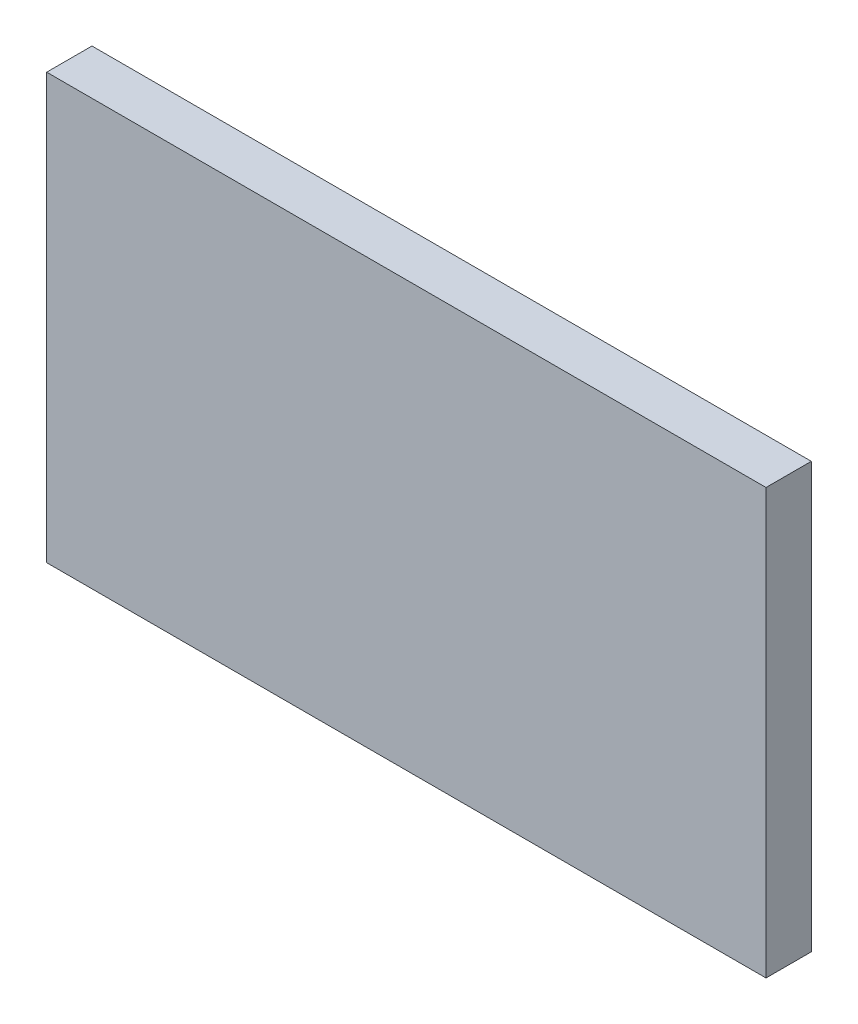
ISO-10303-21;
HEADER;
FILE_DESCRIPTION(('STEP AP214'),'2;1');
FILE_NAME('part.step','',(''),(''),'','','');
FILE_SCHEMA(('AUTOMOTIVE_DESIGN { 1 0 10303 214 1 1 1 1 }'));
ENDSEC;
DATA;
#1=APPLICATION_CONTEXT('core data for automotive mechanical design processes');
#2=APPLICATION_PROTOCOL_DEFINITION('international standard','automotive_design',2000,#1);
#3=PRODUCT_CONTEXT('',#1,'mechanical');
#4=PRODUCT('Part','Part','',(#3));
#5=PRODUCT_RELATED_PRODUCT_CATEGORY('part','',(#4));
#6=PRODUCT_DEFINITION_FORMATION('','',#4);
#7=PRODUCT_DEFINITION_CONTEXT('part definition',#1,'design');
#8=PRODUCT_DEFINITION('design','',#6,#7);
#9=PRODUCT_DEFINITION_SHAPE('','',#8);
#10=(LENGTH_UNIT() NAMED_UNIT(*) SI_UNIT(.MILLI.,.METRE.));
#11=(NAMED_UNIT(*) PLANE_ANGLE_UNIT() SI_UNIT($,.RADIAN.));
#12=(NAMED_UNIT(*) SI_UNIT($,.STERADIAN.) SOLID_ANGLE_UNIT());
#13=UNCERTAINTY_MEASURE_WITH_UNIT(LENGTH_MEASURE(1.E-05),#10,'distance_accuracy_value','');
#14=(GEOMETRIC_REPRESENTATION_CONTEXT(3) GLOBAL_UNCERTAINTY_ASSIGNED_CONTEXT((#13)) GLOBAL_UNIT_ASSIGNED_CONTEXT((#10,
#11,#12)) REPRESENTATION_CONTEXT('',''));
#15=CARTESIAN_POINT('',(0.,0.,0.));
#16=DIRECTION('',(0.,0.,1.));
#17=DIRECTION('',(1.,0.,0.));
#18=AXIS2_PLACEMENT_3D('',#15,#16,#17);
#19=CARTESIAN_POINT('',(0.,0.,6.4));
#20=DIRECTION('',(1.,0.,0.));
#21=DIRECTION('',(0.,0.,-1.));
#22=AXIS2_PLACEMENT_3D('',#19,#20,#21);
#23=PLANE('',#22);
#24=DIRECTION('',(0.,-1.,0.));
#25=VECTOR('',#24,1.);
#26=CARTESIAN_POINT('',(0.,0.,0.));
#27=LINE('',#26,#25);
#28=CARTESIAN_POINT('',(0.,60.,0.));
#29=VERTEX_POINT('',#28);
#30=CARTESIAN_POINT('',(0.,0.,0.));
#31=VERTEX_POINT('',#30);
#32=EDGE_CURVE('E109',#29,#31,#27,.T.);
#33=ORIENTED_EDGE('',*,*,#32,.T.);
#34=DIRECTION('',(0.,0.,-1.));
#35=VECTOR('',#34,1.);
#36=CARTESIAN_POINT('',(0.,0.,6.4));
#37=LINE('',#36,#35);
#38=CARTESIAN_POINT('',(0.,0.,6.4));
#39=VERTEX_POINT('',#38);
#40=EDGE_CURVE('E11',#39,#31,#37,.T.);
#41=ORIENTED_EDGE('',*,*,#40,.F.);
#42=DIRECTION('',(0.,-1.,0.));
#43=VECTOR('',#42,1.);
#44=CARTESIAN_POINT('',(0.,0.,6.4));
#45=LINE('',#44,#43);
#46=CARTESIAN_POINT('',(0.,60.,6.4));
#47=VERTEX_POINT('',#46);
#48=EDGE_CURVE('E93',#47,#39,#45,.T.);
#49=ORIENTED_EDGE('',*,*,#48,.F.);
#50=DIRECTION('',(0.,0.,-1.));
#51=VECTOR('',#50,1.);
#52=CARTESIAN_POINT('',(0.,60.,6.4));
#53=LINE('',#52,#51);
#54=EDGE_CURVE('E105',#47,#29,#53,.T.);
#55=ORIENTED_EDGE('',*,*,#54,.T.);
#56=EDGE_LOOP('',(#33,#41,#49,#55));
#57=FACE_BOUND('',#56,.T.);
#58=ADVANCED_FACE('F41',(#57),#23,.F.);
#59=CARTESIAN_POINT('',(0.,0.,6.4));
#60=DIRECTION('',(0.,1.,0.));
#61=DIRECTION('',(0.,0.,1.));
#62=AXIS2_PLACEMENT_3D('',#59,#60,#61);
#63=PLANE('',#62);
#64=DIRECTION('',(1.,0.,0.));
#65=VECTOR('',#64,1.);
#66=CARTESIAN_POINT('',(0.,0.,0.));
#67=LINE('',#66,#65);
#68=CARTESIAN_POINT('',(101.6,0.,0.));
#69=VERTEX_POINT('',#68);
#70=EDGE_CURVE('E98',#31,#69,#67,.T.);
#71=ORIENTED_EDGE('',*,*,#70,.T.);
#72=DIRECTION('',(0.,0.,-1.));
#73=VECTOR('',#72,1.);
#74=CARTESIAN_POINT('',(101.6,0.,6.4));
#75=LINE('',#74,#73);
#76=CARTESIAN_POINT('',(101.6,0.,6.4));
#77=VERTEX_POINT('',#76);
#78=EDGE_CURVE('E50',#77,#69,#75,.T.);
#79=ORIENTED_EDGE('',*,*,#78,.F.);
#80=DIRECTION('',(1.,0.,0.));
#81=VECTOR('',#80,1.);
#82=CARTESIAN_POINT('',(0.,0.,6.4));
#83=LINE('',#82,#81);
#84=EDGE_CURVE('E88',#39,#77,#83,.T.);
#85=ORIENTED_EDGE('',*,*,#84,.F.);
#86=ORIENTED_EDGE('',*,*,#40,.T.);
#87=EDGE_LOOP('',(#71,#79,#85,#86));
#88=FACE_BOUND('',#87,.T.);
#89=ADVANCED_FACE('F97',(#88),#63,.F.);
#90=CARTESIAN_POINT('',(101.6,0.,6.4));
#91=DIRECTION('',(-1.,0.,0.));
#92=DIRECTION('',(0.,0.,1.));
#93=AXIS2_PLACEMENT_3D('',#90,#91,#92);
#94=PLANE('',#93);
#95=DIRECTION('',(0.,1.,0.));
#96=VECTOR('',#95,1.);
#97=CARTESIAN_POINT('',(101.6,0.,0.));
#98=LINE('',#97,#96);
#99=CARTESIAN_POINT('',(101.6,60.,0.));
#100=VERTEX_POINT('',#99);
#101=EDGE_CURVE('E75',#69,#100,#98,.T.);
#102=ORIENTED_EDGE('',*,*,#101,.T.);
#103=DIRECTION('',(0.,0.,-1.));
#104=VECTOR('',#103,1.);
#105=CARTESIAN_POINT('',(101.6,60.,6.4));
#106=LINE('',#105,#104);
#107=CARTESIAN_POINT('',(101.6,60.,6.4));
#108=VERTEX_POINT('',#107);
#109=EDGE_CURVE('E100',#108,#100,#106,.T.);
#110=ORIENTED_EDGE('',*,*,#109,.F.);
#111=DIRECTION('',(0.,1.,0.));
#112=VECTOR('',#111,1.);
#113=CARTESIAN_POINT('',(101.6,0.,6.4));
#114=LINE('',#113,#112);
#115=EDGE_CURVE('E91',#77,#108,#114,.T.);
#116=ORIENTED_EDGE('',*,*,#115,.F.);
#117=ORIENTED_EDGE('',*,*,#78,.T.);
#118=EDGE_LOOP('',(#102,#110,#116,#117));
#119=FACE_BOUND('',#118,.T.);
#120=ADVANCED_FACE('F101',(#119),#94,.F.);
#121=CARTESIAN_POINT('',(0.,60.,6.4));
#122=DIRECTION('',(0.,-1.,0.));
#123=DIRECTION('',(0.,0.,-1.));
#124=AXIS2_PLACEMENT_3D('',#121,#122,#123);
#125=PLANE('',#124);
#126=DIRECTION('',(-1.,0.,0.));
#127=VECTOR('',#126,1.);
#128=CARTESIAN_POINT('',(0.,60.,0.));
#129=LINE('',#128,#127);
#130=EDGE_CURVE('E81',#100,#29,#129,.T.);
#131=ORIENTED_EDGE('',*,*,#130,.T.);
#132=ORIENTED_EDGE('',*,*,#54,.F.);
#133=DIRECTION('',(-1.,0.,0.));
#134=VECTOR('',#133,1.);
#135=CARTESIAN_POINT('',(0.,60.,6.4));
#136=LINE('',#135,#134);
#137=EDGE_CURVE('E58',#108,#47,#136,.T.);
#138=ORIENTED_EDGE('',*,*,#137,.F.);
#139=ORIENTED_EDGE('',*,*,#109,.T.);
#140=EDGE_LOOP('',(#131,#132,#138,#139));
#141=FACE_BOUND('',#140,.T.);
#142=ADVANCED_FACE('F122',(#141),#125,.F.);
#143=CARTESIAN_POINT('',(0.,0.,6.4));
#144=DIRECTION('',(0.,0.,-1.));
#145=DIRECTION('',(-1.,0.,0.));
#146=AXIS2_PLACEMENT_3D('',#143,#144,#145);
#147=PLANE('',#146);
#148=ORIENTED_EDGE('',*,*,#48,.T.);
#149=ORIENTED_EDGE('',*,*,#84,.T.);
#150=ORIENTED_EDGE('',*,*,#115,.T.);
#151=ORIENTED_EDGE('',*,*,#137,.T.);
#152=EDGE_LOOP('',(#148,#149,#150,#151));
#153=FACE_BOUND('',#152,.T.);
#154=ADVANCED_FACE('F89',(#153),#147,.F.);
#155=CARTESIAN_POINT('',(0.,0.,0.));
#156=DIRECTION('',(0.,0.,-1.));
#157=DIRECTION('',(-1.,0.,0.));
#158=AXIS2_PLACEMENT_3D('',#155,#156,#157);
#159=PLANE('',#158);
#160=ORIENTED_EDGE('',*,*,#32,.F.);
#161=ORIENTED_EDGE('',*,*,#130,.F.);
#162=ORIENTED_EDGE('',*,*,#101,.F.);
#163=ORIENTED_EDGE('',*,*,#70,.F.);
#164=EDGE_LOOP('',(#160,#161,#162,#163));
#165=FACE_BOUND('',#164,.T.);
#166=ADVANCED_FACE('F125',(#165),#159,.T.);
#167=CLOSED_SHELL('',(#58,#89,#120,#142,#154,#166));
#168=MANIFOLD_SOLID_BREP('B2',#167);
#169=ADVANCED_BREP_SHAPE_REPRESENTATION('',(#18,#168),#14);
#170=SHAPE_DEFINITION_REPRESENTATION(#9,#169);
ENDSEC;
END-ISO-10303-21;
